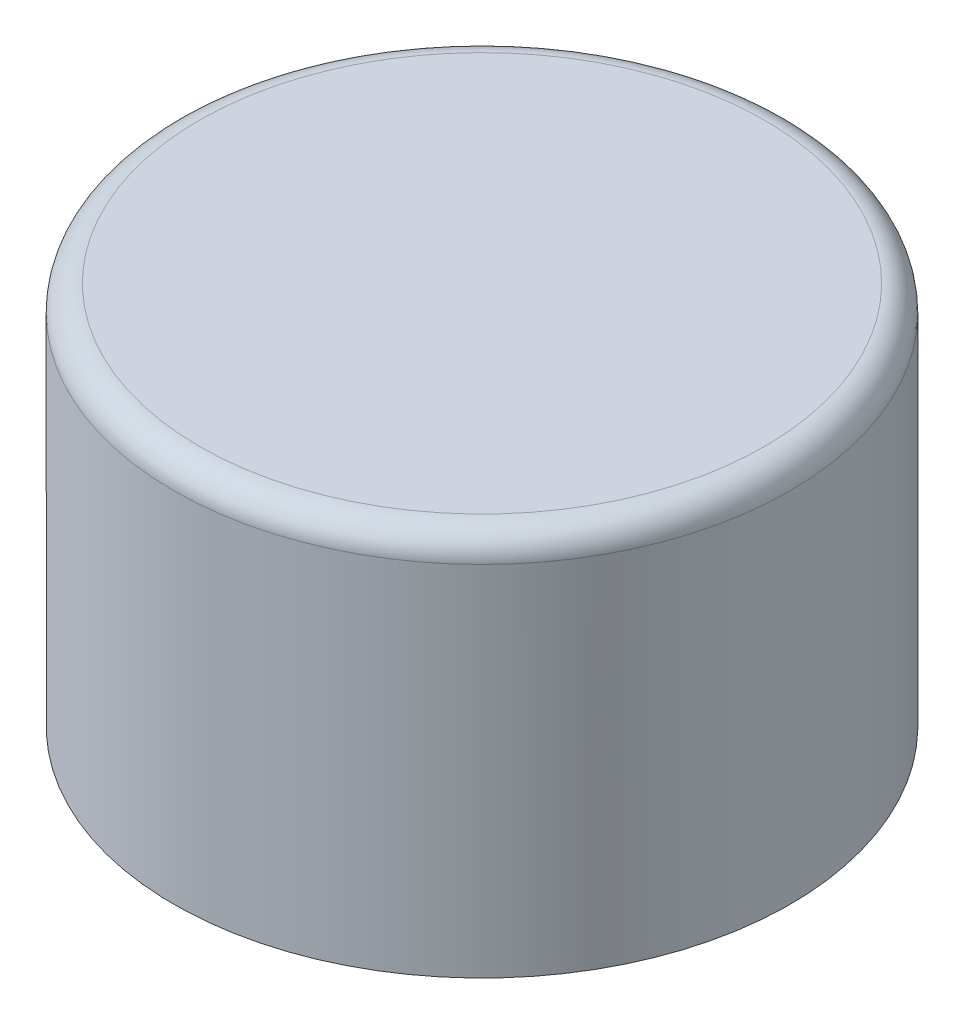
ISO-10303-21;
HEADER;
FILE_DESCRIPTION(('STEP AP214'),'2;1');
FILE_NAME('part.step','',(''),(''),'','','');
FILE_SCHEMA(('AUTOMOTIVE_DESIGN { 1 0 10303 214 1 1 1 1 }'));
ENDSEC;
DATA;
#1=APPLICATION_CONTEXT('core data for automotive mechanical design processes');
#2=APPLICATION_PROTOCOL_DEFINITION('international standard','automotive_design',2000,#1);
#3=PRODUCT_CONTEXT('',#1,'mechanical');
#4=PRODUCT('Part','Part','',(#3));
#5=PRODUCT_RELATED_PRODUCT_CATEGORY('part','',(#4));
#6=PRODUCT_DEFINITION_FORMATION('','',#4);
#7=PRODUCT_DEFINITION_CONTEXT('part definition',#1,'design');
#8=PRODUCT_DEFINITION('design','',#6,#7);
#9=PRODUCT_DEFINITION_SHAPE('','',#8);
#10=(LENGTH_UNIT() NAMED_UNIT(*) SI_UNIT(.MILLI.,.METRE.));
#11=(NAMED_UNIT(*) PLANE_ANGLE_UNIT() SI_UNIT($,.RADIAN.));
#12=(NAMED_UNIT(*) SI_UNIT($,.STERADIAN.) SOLID_ANGLE_UNIT());
#13=UNCERTAINTY_MEASURE_WITH_UNIT(LENGTH_MEASURE(1.E-05),#10,'distance_accuracy_value','');
#14=(GEOMETRIC_REPRESENTATION_CONTEXT(3) GLOBAL_UNCERTAINTY_ASSIGNED_CONTEXT((#13)) GLOBAL_UNIT_ASSIGNED_CONTEXT((#10,
#11,#12)) REPRESENTATION_CONTEXT('',''));
#15=CARTESIAN_POINT('',(0.,0.,0.));
#16=DIRECTION('',(0.,0.,1.));
#17=DIRECTION('',(1.,0.,0.));
#18=AXIS2_PLACEMENT_3D('',#15,#16,#17);
#19=CARTESIAN_POINT('',(0.,38.1,0.));
#20=DIRECTION('',(0.,-1.,0.));
#21=DIRECTION('',(0.,0.,-1.));
#22=AXIS2_PLACEMENT_3D('',#19,#20,#21);
#23=CYLINDRICAL_SURFACE('',#22,30.5943);
#24=CARTESIAN_POINT('',(0.,35.56,0.));
#25=DIRECTION('',(0.,1.,0.));
#26=DIRECTION('',(0.,0.,1.));
#27=AXIS2_PLACEMENT_3D('',#24,#25,#26);
#28=CIRCLE('',#27,30.5943);
#29=CARTESIAN_POINT('',(0.,35.56,-30.5943));
#30=VERTEX_POINT('',#29);
#31=EDGE_CURVE('E10',#30,#30,#28,.F.);
#32=CARTESIAN_POINT('',(0.,0.,0.));
#33=DIRECTION('',(0.,1.,0.));
#34=DIRECTION('',(0.,0.,1.));
#35=AXIS2_PLACEMENT_3D('',#32,#33,#34);
#36=CIRCLE('',#35,30.5943);
#37=CARTESIAN_POINT('',(0.,0.,-30.5943));
#38=VERTEX_POINT('',#37);
#39=EDGE_CURVE('E61',#38,#38,#36,.T.);
#40=CARTESIAN_POINT('',(0.,35.56,-30.5943));
#41=CARTESIAN_POINT('',(0.,35.1895833333333,-30.5943));
#42=CARTESIAN_POINT('',(0.,34.8191666666667,-30.5943));
#43=CARTESIAN_POINT('',(0.,34.0783333333333,-30.5943));
#44=CARTESIAN_POINT('',(0.,33.7079166666667,-30.5943));
#45=CARTESIAN_POINT('',(0.,32.9670833333333,-30.5943));
#46=CARTESIAN_POINT('',(0.,32.5966666666667,-30.5943));
#47=CARTESIAN_POINT('',(0.,31.8558333333333,-30.5943));
#48=CARTESIAN_POINT('',(0.,31.4854166666667,-30.5943));
#49=CARTESIAN_POINT('',(0.,30.7445833333333,-30.5943));
#50=CARTESIAN_POINT('',(0.,30.3741666666667,-30.5943));
#51=CARTESIAN_POINT('',(0.,29.6333333333333,-30.5943));
#52=CARTESIAN_POINT('',(0.,29.2629166666667,-30.5943));
#53=CARTESIAN_POINT('',(0.,28.5220833333333,-30.5943));
#54=CARTESIAN_POINT('',(0.,28.1516666666667,-30.5943));
#55=CARTESIAN_POINT('',(0.,27.4108333333333,-30.5943));
#56=CARTESIAN_POINT('',(0.,27.0404166666667,-30.5943));
#57=CARTESIAN_POINT('',(0.,26.2995833333333,-30.5943));
#58=CARTESIAN_POINT('',(0.,25.9291666666667,-30.5943));
#59=CARTESIAN_POINT('',(0.,25.1883333333333,-30.5943));
#60=CARTESIAN_POINT('',(0.,24.8179166666667,-30.5943));
#61=CARTESIAN_POINT('',(0.,24.0770833333333,-30.5943));
#62=CARTESIAN_POINT('',(0.,23.7066666666667,-30.5943));
#63=CARTESIAN_POINT('',(0.,22.9658333333333,-30.5943));
#64=CARTESIAN_POINT('',(0.,22.5954166666667,-30.5943));
#65=CARTESIAN_POINT('',(0.,21.8545833333333,-30.5943));
#66=CARTESIAN_POINT('',(0.,21.4841666666667,-30.5943));
#67=CARTESIAN_POINT('',(0.,20.7433333333333,-30.5943));
#68=CARTESIAN_POINT('',(0.,20.3729166666667,-30.5943));
#69=CARTESIAN_POINT('',(0.,19.6320833333333,-30.5943));
#70=CARTESIAN_POINT('',(0.,19.2616666666667,-30.5943));
#71=CARTESIAN_POINT('',(0.,18.5208333333333,-30.5943));
#72=CARTESIAN_POINT('',(0.,18.1504166666667,-30.5943));
#73=CARTESIAN_POINT('',(0.,17.4095833333333,-30.5943));
#74=CARTESIAN_POINT('',(0.,17.0391666666667,-30.5943));
#75=CARTESIAN_POINT('',(0.,16.2983333333333,-30.5943));
#76=CARTESIAN_POINT('',(0.,15.9279166666667,-30.5943));
#77=CARTESIAN_POINT('',(0.,15.1870833333333,-30.5943));
#78=CARTESIAN_POINT('',(0.,14.8166666666667,-30.5943));
#79=CARTESIAN_POINT('',(0.,14.0758333333333,-30.5943));
#80=CARTESIAN_POINT('',(0.,13.7054166666667,-30.5943));
#81=CARTESIAN_POINT('',(0.,12.9645833333333,-30.5943));
#82=CARTESIAN_POINT('',(0.,12.5941666666667,-30.5943));
#83=CARTESIAN_POINT('',(0.,11.8533333333333,-30.5943));
#84=CARTESIAN_POINT('',(0.,11.4829166666667,-30.5943));
#85=CARTESIAN_POINT('',(0.,10.7420833333333,-30.5943));
#86=CARTESIAN_POINT('',(0.,10.3716666666667,-30.5943));
#87=CARTESIAN_POINT('',(0.,9.63083333333333,-30.5943));
#88=CARTESIAN_POINT('',(0.,9.26041666666666,-30.5943));
#89=CARTESIAN_POINT('',(0.,8.51958333333333,-30.5943));
#90=CARTESIAN_POINT('',(0.,8.14916666666666,-30.5943));
#91=CARTESIAN_POINT('',(0.,7.40833333333333,-30.5943));
#92=CARTESIAN_POINT('',(0.,7.03791666666666,-30.5943));
#93=CARTESIAN_POINT('',(0.,6.29708333333333,-30.5943));
#94=CARTESIAN_POINT('',(0.,5.92666666666666,-30.5943));
#95=CARTESIAN_POINT('',(0.,5.18583333333333,-30.5943));
#96=CARTESIAN_POINT('',(0.,4.81541666666666,-30.5943));
#97=CARTESIAN_POINT('',(0.,4.07458333333333,-30.5943));
#98=CARTESIAN_POINT('',(0.,3.70416666666666,-30.5943));
#99=CARTESIAN_POINT('',(0.,2.96333333333333,-30.5943));
#100=CARTESIAN_POINT('',(0.,2.59291666666667,-30.5943));
#101=CARTESIAN_POINT('',(0.,1.85208333333333,-30.5943));
#102=CARTESIAN_POINT('',(0.,1.48166666666666,-30.5943));
#103=CARTESIAN_POINT('',(0.,0.740833333333329,-30.5943));
#104=CARTESIAN_POINT('',(0.,0.370416666666665,-30.5943));
#105=CARTESIAN_POINT('',(0.,0.,-30.5943));
#106=B_SPLINE_CURVE_WITH_KNOTS('',3,(#40,#41,#42,#43,#44,#45,#46,#47,#48,#49,#50,#51,#52,#53,
#54,#55,#56,#57,#58,#59,#60,#61,#62,#63,#64,#65,#66,#67,#68,#69,#70,#71,#72,#73,#74,#75,#76,#77,
#78,#79,#80,#81,#82,#83,#84,#85,#86,#87,#88,#89,#90,#91,#92,#93,#94,#95,#96,#97,#98,#99,#100,
#101,#102,#103,#104,#105),.UNSPECIFIED.,.F.,.F.,(4,2,2,2,2,2,2,2,2,2,2,2,2,2,2,2,2,2,2,2,2,2,2,
2,2,2,2,2,2,2,2,2,4),(0.,1.11125,2.2225,3.33375,4.445,5.55625000000001,6.6675,7.77875,8.89,
10.00125,11.1125,12.22375,13.335,14.44625,15.5575,16.66875,17.78,18.89125,20.0025,21.11375,
22.225,23.33625,24.4475,25.55875,26.67,27.78125,28.8925,30.00375,31.115,32.22625,33.3375,
34.44875,35.56),.UNSPECIFIED.);
#107=EDGE_CURVE('BSEAM37',#30,#38,#106,.T.);
#108=ORIENTED_EDGE('',*,*,#31,.T.);
#109=ORIENTED_EDGE('',*,*,#39,.T.);
#110=ORIENTED_EDGE('',*,*,#107,.T.);
#111=ORIENTED_EDGE('',*,*,#107,.F.);
#112=EDGE_LOOP('',(#108,#110,#109,#111));
#113=FACE_BOUND('',#112,.T.);
#114=ADVANCED_FACE('F37',(#113),#23,.T.);
#115=CARTESIAN_POINT('',(0.,38.1,0.));
#116=DIRECTION('',(0.,1.,0.));
#117=DIRECTION('',(0.,0.,1.));
#118=AXIS2_PLACEMENT_3D('',#115,#116,#117);
#119=PLANE('',#118);
#120=CARTESIAN_POINT('',(0.,38.1,0.));
#121=DIRECTION('',(0.,1.,0.));
#122=DIRECTION('',(0.,0.,1.));
#123=AXIS2_PLACEMENT_3D('',#120,#121,#122);
#124=CIRCLE('',#123,28.0543);
#125=CARTESIAN_POINT('',(0.,38.1,28.0543));
#126=VERTEX_POINT('',#125);
#127=EDGE_CURVE('E45',#126,#126,#124,.T.);
#128=ORIENTED_EDGE('',*,*,#127,.T.);
#129=EDGE_LOOP('',(#128));
#130=FACE_BOUND('',#129,.T.);
#131=ADVANCED_FACE('F85',(#130),#119,.T.);
#132=CARTESIAN_POINT('',(0.,0.,0.));
#133=DIRECTION('',(0.,1.,0.));
#134=DIRECTION('',(0.,0.,1.));
#135=AXIS2_PLACEMENT_3D('',#132,#133,#134);
#136=PLANE('',#135);
#137=CARTESIAN_POINT('',(0.,0.,0.));
#138=DIRECTION('',(0.,1.,0.));
#139=DIRECTION('',(0.,0.,1.));
#140=AXIS2_PLACEMENT_3D('',#137,#138,#139);
#141=CIRCLE('',#140,30.3403);
#142=CARTESIAN_POINT('',(0.,0.,-30.3403));
#143=VERTEX_POINT('',#142);
#144=EDGE_CURVE('E65',#143,#143,#141,.T.);
#145=ORIENTED_EDGE('',*,*,#144,.T.);
#146=EDGE_LOOP('',(#145));
#147=FACE_BOUND('',#146,.T.);
#148=ORIENTED_EDGE('',*,*,#39,.F.);
#149=EDGE_LOOP('',(#148));
#150=FACE_BOUND('',#149,.T.);
#151=ADVANCED_FACE('F70',(#147,#150),#136,.F.);
#152=CARTESIAN_POINT('',(0.,38.1,0.));
#153=DIRECTION('',(0.,-1.,0.));
#154=DIRECTION('',(0.,0.,-1.));
#155=AXIS2_PLACEMENT_3D('',#152,#153,#154);
#156=CYLINDRICAL_SURFACE('',#155,30.3403);
#157=CARTESIAN_POINT('',(0.,35.306,0.));
#158=DIRECTION('',(0.,1.,0.));
#159=DIRECTION('',(0.,0.,1.));
#160=AXIS2_PLACEMENT_3D('',#157,#158,#159);
#161=CIRCLE('',#160,30.3403);
#162=CARTESIAN_POINT('',(0.,35.306,-30.3403));
#163=VERTEX_POINT('',#162);
#164=EDGE_CURVE('E55',#163,#163,#161,.T.);
#165=CARTESIAN_POINT('',(0.,35.306,-30.3403));
#166=CARTESIAN_POINT('',(0.,34.9382291666667,-30.3403));
#167=CARTESIAN_POINT('',(0.,34.5704583333333,-30.3403));
#168=CARTESIAN_POINT('',(0.,33.8349166666667,-30.3403));
#169=CARTESIAN_POINT('',(0.,33.4671458333333,-30.3403));
#170=CARTESIAN_POINT('',(0.,32.7316041666667,-30.3403));
#171=CARTESIAN_POINT('',(0.,32.3638333333333,-30.3403));
#172=CARTESIAN_POINT('',(0.,31.6282916666667,-30.3403));
#173=CARTESIAN_POINT('',(0.,31.2605208333333,-30.3403));
#174=CARTESIAN_POINT('',(0.,30.5249791666667,-30.3403));
#175=CARTESIAN_POINT('',(0.,30.1572083333333,-30.3403));
#176=CARTESIAN_POINT('',(0.,29.4216666666667,-30.3403));
#177=CARTESIAN_POINT('',(0.,29.0538958333333,-30.3403));
#178=CARTESIAN_POINT('',(0.,28.3183541666667,-30.3403));
#179=CARTESIAN_POINT('',(0.,27.9505833333333,-30.3403));
#180=CARTESIAN_POINT('',(0.,27.2150416666667,-30.3403));
#181=CARTESIAN_POINT('',(0.,26.8472708333333,-30.3403));
#182=CARTESIAN_POINT('',(0.,26.1117291666667,-30.3403));
#183=CARTESIAN_POINT('',(0.,25.7439583333333,-30.3403));
#184=CARTESIAN_POINT('',(0.,25.0084166666667,-30.3403));
#185=CARTESIAN_POINT('',(0.,24.6406458333333,-30.3403));
#186=CARTESIAN_POINT('',(0.,23.9051041666667,-30.3403));
#187=CARTESIAN_POINT('',(0.,23.5373333333333,-30.3403));
#188=CARTESIAN_POINT('',(0.,22.8017916666667,-30.3403));
#189=CARTESIAN_POINT('',(0.,22.4340208333333,-30.3403));
#190=CARTESIAN_POINT('',(0.,21.6984791666667,-30.3403));
#191=CARTESIAN_POINT('',(0.,21.3307083333333,-30.3403));
#192=CARTESIAN_POINT('',(0.,20.5951666666667,-30.3403));
#193=CARTESIAN_POINT('',(0.,20.2273958333333,-30.3403));
#194=CARTESIAN_POINT('',(0.,19.4918541666667,-30.3403));
#195=CARTESIAN_POINT('',(0.,19.1240833333333,-30.3403));
#196=CARTESIAN_POINT('',(0.,18.3885416666667,-30.3403));
#197=CARTESIAN_POINT('',(0.,18.0207708333333,-30.3403));
#198=CARTESIAN_POINT('',(0.,17.2852291666667,-30.3403));
#199=CARTESIAN_POINT('',(0.,16.9174583333333,-30.3403));
#200=CARTESIAN_POINT('',(0.,16.1819166666667,-30.3403));
#201=CARTESIAN_POINT('',(0.,15.8141458333333,-30.3403));
#202=CARTESIAN_POINT('',(0.,15.0786041666667,-30.3403));
#203=CARTESIAN_POINT('',(0.,14.7108333333333,-30.3403));
#204=CARTESIAN_POINT('',(0.,13.9752916666667,-30.3403));
#205=CARTESIAN_POINT('',(0.,13.6075208333333,-30.3403));
#206=CARTESIAN_POINT('',(0.,12.8719791666667,-30.3403));
#207=CARTESIAN_POINT('',(0.,12.5042083333333,-30.3403));
#208=CARTESIAN_POINT('',(0.,11.7686666666667,-30.3403));
#209=CARTESIAN_POINT('',(0.,11.4008958333333,-30.3403));
#210=CARTESIAN_POINT('',(0.,10.6653541666667,-30.3403));
#211=CARTESIAN_POINT('',(0.,10.2975833333333,-30.3403));
#212=CARTESIAN_POINT('',(0.,9.56204166666667,-30.3403));
#213=CARTESIAN_POINT('',(0.,9.19427083333334,-30.3403));
#214=CARTESIAN_POINT('',(0.,8.45872916666667,-30.3403));
#215=CARTESIAN_POINT('',(0.,8.09095833333333,-30.3403));
#216=CARTESIAN_POINT('',(0.,7.35541666666667,-30.3403));
#217=CARTESIAN_POINT('',(0.,6.98764583333334,-30.3403));
#218=CARTESIAN_POINT('',(0.,6.25210416666667,-30.3403));
#219=CARTESIAN_POINT('',(0.,5.88433333333334,-30.3403));
#220=CARTESIAN_POINT('',(0.,5.14879166666667,-30.3403));
#221=CARTESIAN_POINT('',(0.,4.78102083333333,-30.3403));
#222=CARTESIAN_POINT('',(0.,4.04547916666667,-30.3403));
#223=CARTESIAN_POINT('',(0.,3.67770833333333,-30.3403));
#224=CARTESIAN_POINT('',(0.,2.94216666666667,-30.3403));
#225=CARTESIAN_POINT('',(0.,2.57439583333334,-30.3403));
#226=CARTESIAN_POINT('',(0.,1.83885416666667,-30.3403));
#227=CARTESIAN_POINT('',(0.,1.47108333333334,-30.3403));
#228=CARTESIAN_POINT('',(0.,0.735541666666668,-30.3403));
#229=CARTESIAN_POINT('',(0.,0.367770833333333,-30.3403));
#230=CARTESIAN_POINT('',(0.,0.,-30.3403));
#231=B_SPLINE_CURVE_WITH_KNOTS('',3,(#165,#166,#167,#168,#169,#170,#171,#172,#173,#174,#175,
#176,#177,#178,#179,#180,#181,#182,#183,#184,#185,#186,#187,#188,#189,#190,#191,#192,#193,#194,
#195,#196,#197,#198,#199,#200,#201,#202,#203,#204,#205,#206,#207,#208,#209,#210,#211,#212,#213,
#214,#215,#216,#217,#218,#219,#220,#221,#222,#223,#224,#225,#226,#227,#228,#229,#230),
.UNSPECIFIED.,.F.,.F.,(4,2,2,2,2,2,2,2,2,2,2,2,2,2,2,2,2,2,2,2,2,2,2,2,2,2,2,2,2,2,2,2,4),(0.,
1.1033125,2.206625,3.3099375,4.41325,5.5165625,6.619875,7.7231875,8.82649999999999,9.9298125,
11.033125,12.1364375,13.23975,14.3430625,15.446375,16.5496875,17.653,18.7563125,19.859625,
20.9629375,22.06625,23.1695625,24.272875,25.3761875,26.4795,27.5828125,28.686125,29.7894375,
30.89275,31.9960625,33.099375,34.2026875,35.306),.UNSPECIFIED.);
#232=EDGE_CURVE('BSEAM73',#163,#143,#231,.T.);
#233=ORIENTED_EDGE('',*,*,#164,.T.);
#234=ORIENTED_EDGE('',*,*,#144,.F.);
#235=ORIENTED_EDGE('',*,*,#232,.T.);
#236=ORIENTED_EDGE('',*,*,#232,.F.);
#237=EDGE_LOOP('',(#233,#235,#234,#236));
#238=FACE_BOUND('',#237,.T.);
#239=ADVANCED_FACE('F73',(#238),#156,.F.);
#240=CARTESIAN_POINT('',(0.,37.846,0.));
#241=DIRECTION('',(0.,1.,0.));
#242=DIRECTION('',(0.,0.,1.));
#243=AXIS2_PLACEMENT_3D('',#240,#241,#242);
#244=PLANE('',#243);
#245=CARTESIAN_POINT('',(0.,37.846,0.));
#246=DIRECTION('',(0.,1.,0.));
#247=DIRECTION('',(0.,0.,1.));
#248=AXIS2_PLACEMENT_3D('',#245,#246,#247);
#249=CIRCLE('',#248,27.8003);
#250=CARTESIAN_POINT('',(0.,37.846,27.8003));
#251=VERTEX_POINT('',#250);
#252=EDGE_CURVE('E50',#251,#251,#249,.F.);
#253=ORIENTED_EDGE('',*,*,#252,.T.);
#254=EDGE_LOOP('',(#253));
#255=FACE_BOUND('',#254,.T.);
#256=ADVANCED_FACE('F75',(#255),#244,.F.);
#257=CARTESIAN_POINT('',(0.,35.306,0.));
#258=DIRECTION('',(0.,1.,0.));
#259=DIRECTION('',(0.,0.,1.));
#260=AXIS2_PLACEMENT_3D('',#257,#258,#259);
#261=TOROIDAL_SURFACE('',#260,27.8003,2.54);
#262=ORIENTED_EDGE('',*,*,#252,.F.);
#263=EDGE_LOOP('',(#262));
#264=FACE_BOUND('',#263,.T.);
#265=ORIENTED_EDGE('',*,*,#164,.F.);
#266=EDGE_LOOP('',(#265));
#267=FACE_BOUND('',#266,.T.);
#268=ADVANCED_FACE('F82',(#264,#267),#261,.F.);
#269=CARTESIAN_POINT('',(0.,35.56,0.));
#270=DIRECTION('',(0.,1.,0.));
#271=DIRECTION('',(0.,0.,1.));
#272=AXIS2_PLACEMENT_3D('',#269,#270,#271);
#273=TOROIDAL_SURFACE('',#272,28.0543,2.54);
#274=ORIENTED_EDGE('',*,*,#31,.F.);
#275=EDGE_LOOP('',(#274));
#276=FACE_BOUND('',#275,.T.);
#277=ORIENTED_EDGE('',*,*,#127,.F.);
#278=EDGE_LOOP('',(#277));
#279=FACE_BOUND('',#278,.T.);
#280=ADVANCED_FACE('F39',(#276,#279),#273,.T.);
#281=CLOSED_SHELL('',(#114,#131,#151,#239,#256,#268,#280));
#282=MANIFOLD_SOLID_BREP('B2',#281);
#283=ADVANCED_BREP_SHAPE_REPRESENTATION('',(#18,#282),#14);
#284=SHAPE_DEFINITION_REPRESENTATION(#9,#283);
ENDSEC;
END-ISO-10303-21;
